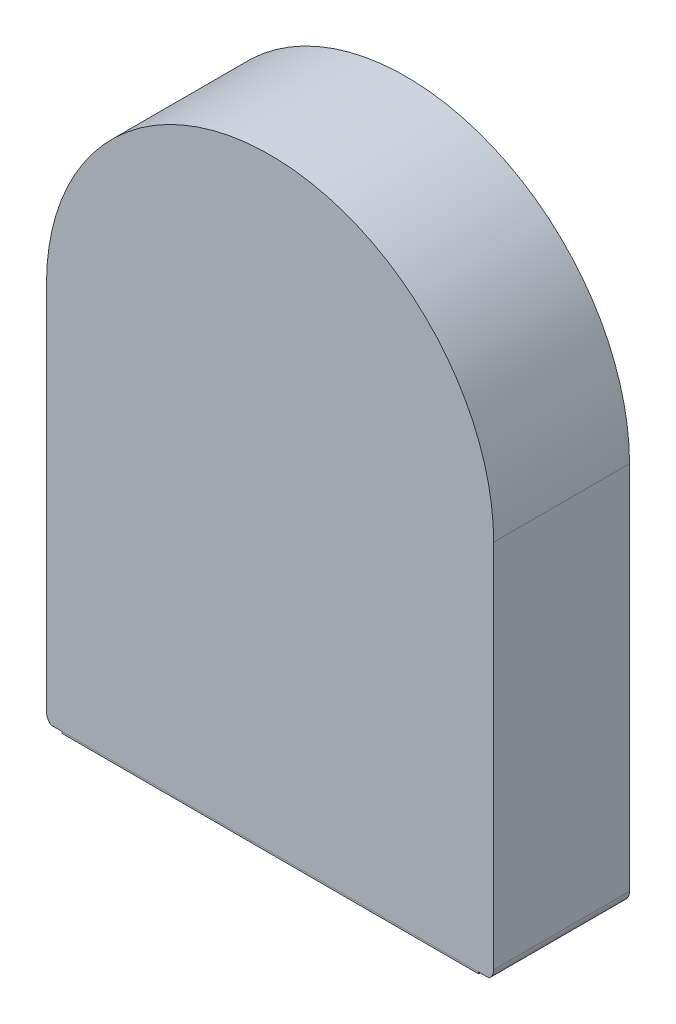
ISO-10303-21;
HEADER;
FILE_DESCRIPTION(('STEP AP214'),'2;1');
FILE_NAME('part.step','',(''),(''),'','','');
FILE_SCHEMA(('AUTOMOTIVE_DESIGN { 1 0 10303 214 1 1 1 1 }'));
ENDSEC;
DATA;
#1=APPLICATION_CONTEXT('core data for automotive mechanical design processes');
#2=APPLICATION_PROTOCOL_DEFINITION('international standard','automotive_design',2000,#1);
#3=PRODUCT_CONTEXT('',#1,'mechanical');
#4=PRODUCT('Part','Part','',(#3));
#5=PRODUCT_RELATED_PRODUCT_CATEGORY('part','',(#4));
#6=PRODUCT_DEFINITION_FORMATION('','',#4);
#7=PRODUCT_DEFINITION_CONTEXT('part definition',#1,'design');
#8=PRODUCT_DEFINITION('design','',#6,#7);
#9=PRODUCT_DEFINITION_SHAPE('','',#8);
#10=(LENGTH_UNIT() NAMED_UNIT(*) SI_UNIT(.MILLI.,.METRE.));
#11=(NAMED_UNIT(*) PLANE_ANGLE_UNIT() SI_UNIT($,.RADIAN.));
#12=(NAMED_UNIT(*) SI_UNIT($,.STERADIAN.) SOLID_ANGLE_UNIT());
#13=UNCERTAINTY_MEASURE_WITH_UNIT(LENGTH_MEASURE(1.E-05),#10,'distance_accuracy_value','');
#14=(GEOMETRIC_REPRESENTATION_CONTEXT(3) GLOBAL_UNCERTAINTY_ASSIGNED_CONTEXT((#13)) GLOBAL_UNIT_ASSIGNED_CONTEXT((#10,
#11,#12)) REPRESENTATION_CONTEXT('',''));
#15=CARTESIAN_POINT('',(0.,0.,0.));
#16=DIRECTION('',(0.,0.,1.));
#17=DIRECTION('',(1.,0.,0.));
#18=AXIS2_PLACEMENT_3D('',#15,#16,#17);
#19=CARTESIAN_POINT('',(8.8,-15.4,5.65));
#20=DIRECTION('',(0.,0.,-1.));
#21=DIRECTION('',(-1.,0.,0.));
#22=AXIS2_PLACEMENT_3D('',#19,#20,#21);
#23=CYLINDRICAL_SURFACE('',#22,0.5);
#24=CARTESIAN_POINT('',(8.8,-15.4,6.03039935251033));
#25=DIRECTION('',(0.,0.713250449154018,-0.700909264300018));
#26=DIRECTION('',(0.,0.700909264300018,0.713250449154018));
#27=AXIS2_PLACEMENT_3D('',#24,#25,#26);
#28=ELLIPSE('',#27,0.713359097199747,0.5);
#29=CARTESIAN_POINT('',(9.10934525688194,-15.79281740293,5.63066545920087));
#30=VERTEX_POINT('',#29);
#31=CARTESIAN_POINT('',(8.8,-15.9,5.52159565602451));
#32=VERTEX_POINT('',#31);
#33=EDGE_CURVE('E56',#30,#32,#28,.T.);
#34=ORIENTED_EDGE('',*,*,#33,.T.);
#35=DIRECTION('',(0.,0.,-1.));
#36=VECTOR('',#35,1.);
#37=CARTESIAN_POINT('',(8.8,-15.9,5.65));
#38=LINE('',#37,#36);
#39=CARTESIAN_POINT('',(8.8,-15.9,0.));
#40=VERTEX_POINT('',#39);
#41=EDGE_CURVE('E258',#40,#32,#38,.F.);
#42=ORIENTED_EDGE('',*,*,#41,.F.);
#43=CARTESIAN_POINT('',(8.8,-15.4,0.));
#44=DIRECTION('',(0.,0.,1.));
#45=DIRECTION('',(1.,0.,0.));
#46=AXIS2_PLACEMENT_3D('',#43,#44,#45);
#47=CIRCLE('',#46,0.5);
#48=CARTESIAN_POINT('',(9.3,-15.4,0.));
#49=VERTEX_POINT('',#48);
#50=EDGE_CURVE('E262',#49,#40,#47,.F.);
#51=ORIENTED_EDGE('',*,*,#50,.F.);
#52=DIRECTION('',(0.,0.,-1.));
#53=VECTOR('',#52,1.);
#54=CARTESIAN_POINT('',(9.3,-15.4,5.65));
#55=LINE('',#54,#53);
#56=CARTESIAN_POINT('',(9.3,-15.4,5.65));
#57=VERTEX_POINT('',#56);
#58=EDGE_CURVE('E266',#57,#49,#55,.T.);
#59=ORIENTED_EDGE('',*,*,#58,.F.);
#60=CARTESIAN_POINT('',(8.8,-15.4,5.65));
#61=DIRECTION('',(0.,0.,1.));
#62=DIRECTION('',(1.,0.,0.));
#63=AXIS2_PLACEMENT_3D('',#60,#61,#62);
#64=CIRCLE('',#63,0.5);
#65=CARTESIAN_POINT('',(9.10934525688194,-15.79281740293,5.65));
#66=VERTEX_POINT('',#65);
#67=EDGE_CURVE('E253',#66,#57,#64,.T.);
#68=ORIENTED_EDGE('',*,*,#67,.F.);
#69=DIRECTION('',(0.,0.,-1.));
#70=VECTOR('',#69,1.);
#71=CARTESIAN_POINT('',(9.10934525730095,-15.7928174026,5.65));
#72=LINE('',#71,#70);
#73=EDGE_CURVE('E49',#30,#66,#72,.F.);
#74=ORIENTED_EDGE('',*,*,#73,.F.);
#75=EDGE_LOOP('',(#34,#42,#51,#59,#68,#74));
#76=FACE_BOUND('',#75,.T.);
#77=ADVANCED_FACE('F39',(#76),#23,.T.);
#78=CARTESIAN_POINT('',(-8.8,-15.4,5.65));
#79=DIRECTION('',(0.,0.,-1.));
#80=DIRECTION('',(-1.,0.,0.));
#81=AXIS2_PLACEMENT_3D('',#78,#79,#80);
#82=CYLINDRICAL_SURFACE('',#81,0.5);
#83=CARTESIAN_POINT('',(-8.8,-15.4,5.65));
#84=DIRECTION('',(0.,0.,1.));
#85=DIRECTION('',(1.,0.,0.));
#86=AXIS2_PLACEMENT_3D('',#83,#84,#85);
#87=CIRCLE('',#86,0.5);
#88=CARTESIAN_POINT('',(-9.3,-15.4,5.65));
#89=VERTEX_POINT('',#88);
#90=CARTESIAN_POINT('',(-9.10934525730095,-15.7928174026,5.65));
#91=VERTEX_POINT('',#90);
#92=EDGE_CURVE('E255',#89,#91,#87,.T.);
#93=ORIENTED_EDGE('',*,*,#92,.F.);
#94=DIRECTION('',(0.,0.,-1.));
#95=VECTOR('',#94,1.);
#96=CARTESIAN_POINT('',(-9.3,-15.4,5.65));
#97=LINE('',#96,#95);
#98=CARTESIAN_POINT('',(-9.3,-15.4,0.));
#99=VERTEX_POINT('',#98);
#100=EDGE_CURVE('E251',#99,#89,#97,.F.);
#101=ORIENTED_EDGE('',*,*,#100,.F.);
#102=CARTESIAN_POINT('',(-8.8,-15.4,0.));
#103=DIRECTION('',(0.,0.,1.));
#104=DIRECTION('',(1.,0.,0.));
#105=AXIS2_PLACEMENT_3D('',#102,#103,#104);
#106=CIRCLE('',#105,0.5);
#107=CARTESIAN_POINT('',(-8.8,-15.9,0.));
#108=VERTEX_POINT('',#107);
#109=EDGE_CURVE('E264',#108,#99,#106,.F.);
#110=ORIENTED_EDGE('',*,*,#109,.F.);
#111=DIRECTION('',(0.,0.,-1.));
#112=VECTOR('',#111,1.);
#113=CARTESIAN_POINT('',(-8.8,-15.9,5.65));
#114=LINE('',#113,#112);
#115=CARTESIAN_POINT('',(-8.8,-15.9,5.52159565602451));
#116=VERTEX_POINT('',#115);
#117=EDGE_CURVE('E260',#116,#108,#114,.T.);
#118=ORIENTED_EDGE('',*,*,#117,.F.);
#119=CARTESIAN_POINT('',(-8.8,-15.4,6.03039935251033));
#120=DIRECTION('',(0.,0.713250449154018,-0.700909264300018));
#121=DIRECTION('',(0.,0.700909264300018,0.713250449154018));
#122=AXIS2_PLACEMENT_3D('',#119,#120,#121);
#123=ELLIPSE('',#122,0.713359097199747,0.5);
#124=CARTESIAN_POINT('',(-9.10934525730095,-15.7928174026,5.63066545953665));
#125=VERTEX_POINT('',#124);
#126=EDGE_CURVE('E146',#116,#125,#123,.T.);
#127=ORIENTED_EDGE('',*,*,#126,.T.);
#128=DIRECTION('',(0.,0.,1.));
#129=VECTOR('',#128,1.);
#130=CARTESIAN_POINT('',(-9.10934525730095,-15.7928174026,5.63066545953665));
#131=LINE('',#130,#129);
#132=EDGE_CURVE('E196',#125,#91,#131,.T.);
#133=ORIENTED_EDGE('',*,*,#132,.T.);
#134=EDGE_LOOP('',(#93,#101,#110,#118,#127,#133));
#135=FACE_BOUND('',#134,.T.);
#136=ADVANCED_FACE('F41',(#135),#82,.T.);
#137=CARTESIAN_POINT('',(0.,0.,5.65));
#138=DIRECTION('',(0.,0.,-1.));
#139=DIRECTION('',(-1.,0.,0.));
#140=AXIS2_PLACEMENT_3D('',#137,#138,#139);
#141=CYLINDRICAL_SURFACE('',#140,9.3);
#142=CARTESIAN_POINT('',(0.,0.,0.));
#143=DIRECTION('',(0.,0.,1.));
#144=DIRECTION('',(1.,0.,0.));
#145=AXIS2_PLACEMENT_3D('',#142,#143,#144);
#146=CIRCLE('',#145,9.3);
#147=CARTESIAN_POINT('',(9.3,0.,0.));
#148=VERTEX_POINT('',#147);
#149=CARTESIAN_POINT('',(-9.3,0.,0.));
#150=VERTEX_POINT('',#149);
#151=EDGE_CURVE('E201',#148,#150,#146,.T.);
#152=ORIENTED_EDGE('',*,*,#151,.T.);
#153=DIRECTION('',(0.,0.,-1.));
#154=VECTOR('',#153,1.);
#155=CARTESIAN_POINT('',(-9.3,0.,5.65));
#156=LINE('',#155,#154);
#157=CARTESIAN_POINT('',(-9.3,0.,5.65));
#158=VERTEX_POINT('',#157);
#159=EDGE_CURVE('E268',#158,#150,#156,.T.);
#160=ORIENTED_EDGE('',*,*,#159,.F.);
#161=CARTESIAN_POINT('',(0.,0.,5.65));
#162=DIRECTION('',(0.,0.,1.));
#163=DIRECTION('',(1.,0.,0.));
#164=AXIS2_PLACEMENT_3D('',#161,#162,#163);
#165=CIRCLE('',#164,9.3);
#166=CARTESIAN_POINT('',(9.3,0.,5.65));
#167=VERTEX_POINT('',#166);
#168=EDGE_CURVE('E245',#167,#158,#165,.T.);
#169=ORIENTED_EDGE('',*,*,#168,.F.);
#170=DIRECTION('',(0.,0.,-1.));
#171=VECTOR('',#170,1.);
#172=CARTESIAN_POINT('',(9.3,0.,5.65));
#173=LINE('',#172,#171);
#174=EDGE_CURVE('E270',#167,#148,#173,.T.);
#175=ORIENTED_EDGE('',*,*,#174,.T.);
#176=EDGE_LOOP('',(#152,#160,#169,#175));
#177=FACE_BOUND('',#176,.T.);
#178=ADVANCED_FACE('F358',(#177),#141,.T.);
#179=CARTESIAN_POINT('',(-9.3,0.,5.65));
#180=DIRECTION('',(1.,0.,0.));
#181=DIRECTION('',(0.,1.,0.));
#182=AXIS2_PLACEMENT_3D('',#179,#180,#181);
#183=PLANE('',#182);
#184=ORIENTED_EDGE('',*,*,#159,.T.);
#185=DIRECTION('',(0.,-1.,0.));
#186=VECTOR('',#185,1.);
#187=CARTESIAN_POINT('',(-9.3,0.,0.));
#188=LINE('',#187,#186);
#189=EDGE_CURVE('E278',#150,#99,#188,.T.);
#190=ORIENTED_EDGE('',*,*,#189,.T.);
#191=ORIENTED_EDGE('',*,*,#100,.T.);
#192=DIRECTION('',(0.,-1.,0.));
#193=VECTOR('',#192,1.);
#194=CARTESIAN_POINT('',(-9.3,0.,5.65));
#195=LINE('',#194,#193);
#196=EDGE_CURVE('E242',#158,#89,#195,.T.);
#197=ORIENTED_EDGE('',*,*,#196,.F.);
#198=EDGE_LOOP('',(#184,#190,#191,#197));
#199=FACE_BOUND('',#198,.T.);
#200=ADVANCED_FACE('F359',(#199),#183,.F.);
#201=CARTESIAN_POINT('',(-9.3,-15.9,5.65));
#202=DIRECTION('',(0.,1.,0.));
#203=DIRECTION('',(0.,0.,1.));
#204=AXIS2_PLACEMENT_3D('',#201,#202,#203);
#205=PLANE('',#204);
#206=ORIENTED_EDGE('',*,*,#41,.T.);
#207=DIRECTION('',(-1.,0.,0.));
#208=VECTOR('',#207,1.);
#209=CARTESIAN_POINT('',(0.,-15.9,5.52159565602451));
#210=LINE('',#209,#208);
#211=EDGE_CURVE('E338',#32,#116,#210,.T.);
#212=ORIENTED_EDGE('',*,*,#211,.T.);
#213=ORIENTED_EDGE('',*,*,#117,.T.);
#214=DIRECTION('',(1.,0.,0.));
#215=VECTOR('',#214,1.);
#216=CARTESIAN_POINT('',(-9.3,-15.9,0.));
#217=LINE('',#216,#215);
#218=EDGE_CURVE('E275',#108,#40,#217,.T.);
#219=ORIENTED_EDGE('',*,*,#218,.T.);
#220=EDGE_LOOP('',(#206,#212,#213,#219));
#221=FACE_BOUND('',#220,.T.);
#222=ADVANCED_FACE('F344',(#221),#205,.F.);
#223=CARTESIAN_POINT('',(9.3,0.,5.65));
#224=DIRECTION('',(-1.,0.,0.));
#225=DIRECTION('',(0.,-1.,0.));
#226=AXIS2_PLACEMENT_3D('',#223,#224,#225);
#227=PLANE('',#226);
#228=ORIENTED_EDGE('',*,*,#58,.T.);
#229=DIRECTION('',(0.,1.,0.));
#230=VECTOR('',#229,1.);
#231=CARTESIAN_POINT('',(9.3,0.,0.));
#232=LINE('',#231,#230);
#233=EDGE_CURVE('E248',#49,#148,#232,.T.);
#234=ORIENTED_EDGE('',*,*,#233,.T.);
#235=ORIENTED_EDGE('',*,*,#174,.F.);
#236=DIRECTION('',(0.,1.,0.));
#237=VECTOR('',#236,1.);
#238=CARTESIAN_POINT('',(9.3,0.,5.65));
#239=LINE('',#238,#237);
#240=EDGE_CURVE('E272',#57,#167,#239,.T.);
#241=ORIENTED_EDGE('',*,*,#240,.F.);
#242=EDGE_LOOP('',(#228,#234,#235,#241));
#243=FACE_BOUND('',#242,.T.);
#244=ADVANCED_FACE('F355',(#243),#227,.F.);
#245=CARTESIAN_POINT('',(0.,0.,5.65));
#246=DIRECTION('',(0.,0.,1.));
#247=DIRECTION('',(1.,0.,0.));
#248=AXIS2_PLACEMENT_3D('',#245,#246,#247);
#249=PLANE('',#248);
#250=DIRECTION('',(1.,0.,0.));
#251=VECTOR('',#250,1.);
#252=CARTESIAN_POINT('',(-5.00000000075,-15.7926514013,5.64999710245));
#253=LINE('',#252,#251);
#254=CARTESIAN_POINT('',(-6.97971042440521,-15.7927344019421,5.64999855122482));
#255=VERTEX_POINT('',#254);
#256=CARTESIAN_POINT('',(2.97381740255382,-15.7926513759911,5.64999855122139));
#257=VERTEX_POINT('',#256);
#258=EDGE_CURVE('E177',#255,#257,#253,.T.);
#259=ORIENTED_EDGE('',*,*,#258,.T.);
#260=DIRECTION('',(0.999999999999744,1.24820653344968E-08,7.15097058320817E-07));
#261=VECTOR('',#260,1.);
#262=CARTESIAN_POINT('',(4.99999999925,-15.792651376,5.64999855136));
#263=LINE('',#262,#261);
#264=CARTESIAN_POINT('',(6.97971041935568,-15.7927343769389,5.64999998352249));
#265=VERTEX_POINT('',#264);
#266=EDGE_CURVE('E180',#257,#265,#263,.T.);
#267=ORIENTED_EDGE('',*,*,#266,.T.);
#268=DIRECTION('',(-1.,0.,0.));
#269=VECTOR('',#268,1.);
#270=CARTESIAN_POINT('',(0.,-15.7928174026,5.65));
#271=LINE('',#270,#269);
#272=EDGE_CURVE('E199',#66,#265,#271,.T.);
#273=ORIENTED_EDGE('',*,*,#272,.F.);
#274=ORIENTED_EDGE('',*,*,#67,.T.);
#275=ORIENTED_EDGE('',*,*,#240,.T.);
#276=ORIENTED_EDGE('',*,*,#168,.T.);
#277=ORIENTED_EDGE('',*,*,#196,.T.);
#278=ORIENTED_EDGE('',*,*,#92,.T.);
#279=DIRECTION('',(-1.,0.,0.));
#280=VECTOR('',#279,1.);
#281=CARTESIAN_POINT('',(0.,-15.7928174026,5.65));
#282=LINE('',#281,#280);
#283=EDGE_CURVE('E11',#255,#91,#282,.T.);
#284=ORIENTED_EDGE('',*,*,#283,.F.);
#285=EDGE_LOOP('',(#259,#267,#273,#274,#275,#276,#277,#278,#284));
#286=FACE_BOUND('',#285,.T.);
#287=ADVANCED_FACE('F288',(#286),#249,.T.);
#288=CARTESIAN_POINT('',(0.,0.,0.));
#289=DIRECTION('',(0.,0.,1.));
#290=DIRECTION('',(1.,0.,0.));
#291=AXIS2_PLACEMENT_3D('',#288,#289,#290);
#292=PLANE('',#291);
#293=ORIENTED_EDGE('',*,*,#233,.F.);
#294=ORIENTED_EDGE('',*,*,#50,.T.);
#295=ORIENTED_EDGE('',*,*,#218,.F.);
#296=ORIENTED_EDGE('',*,*,#109,.T.);
#297=ORIENTED_EDGE('',*,*,#189,.F.);
#298=ORIENTED_EDGE('',*,*,#151,.F.);
#299=EDGE_LOOP('',(#293,#294,#295,#296,#297,#298));
#300=FACE_BOUND('',#299,.T.);
#301=ADVANCED_FACE('F221',(#300),#292,.F.);
#302=CARTESIAN_POINT('',(-10.,-15.7928174026,7.15));
#303=DIRECTION('',(0.,1.,0.));
#304=DIRECTION('',(0.,0.,1.));
#305=AXIS2_PLACEMENT_3D('',#302,#303,#304);
#306=PLANE('',#305);
#307=ORIENTED_EDGE('',*,*,#272,.T.);
#308=CARTESIAN_POINT('',(6.97975192830906,-15.7928174026,5.64048689252252));
#309=DIRECTION('',(-0.00436264473487639,0.0174522403538263,0.999838180225955));
#310=VECTOR('',#309,1.);
#311=LINE('',#308,#310);
#312=CARTESIAN_POINT('',(6.97975192830905,-15.7928174026,5.64048689252252));
#313=VERTEX_POINT('',#312);
#314=EDGE_CURVE('E188',#313,#265,#311,.T.);
#315=ORIENTED_EDGE('',*,*,#314,.F.);
#316=DIRECTION('',(1.,0.,0.));
#317=VECTOR('',#316,1.);
#318=CARTESIAN_POINT('',(-8.66700053469144,-15.7928174026,5.64048689252252));
#319=LINE('',#318,#317);
#320=CARTESIAN_POINT('',(8.66820089689577,-15.7928174026,5.64048689252252));
#321=VERTEX_POINT('',#320);
#322=EDGE_CURVE('E161',#313,#321,#319,.T.);
#323=ORIENTED_EDGE('',*,*,#322,.T.);
#324=DIRECTION('',(0.,0.,-1.));
#325=VECTOR('',#324,1.);
#326=CARTESIAN_POINT('',(8.66820089689577,-15.7928174026,0.999999999999998));
#327=LINE('',#326,#325);
#328=CARTESIAN_POINT('',(8.66821322781486,-15.7928174036935,5.63066545842397));
#329=VERTEX_POINT('',#328);
#330=EDGE_CURVE('E153',#321,#329,#327,.T.);
#331=ORIENTED_EDGE('',*,*,#330,.T.);
#332=DIRECTION('',(-1.,-1.73074002985439E-09,-1.7612138496918E-09));
#333=VECTOR('',#332,1.);
#334=CARTESIAN_POINT('',(-4.9999999983754,-15.7928174273496,5.6306654343513));
#335=LINE('',#334,#333);
#336=EDGE_CURVE('E137',#30,#329,#335,.T.);
#337=ORIENTED_EDGE('',*,*,#336,.F.);
#338=ORIENTED_EDGE('',*,*,#73,.T.);
#339=EDGE_LOOP('',(#307,#315,#323,#331,#337,#338));
#340=FACE_BOUND('',#339,.T.);
#341=ADVANCED_FACE('F158',(#340),#306,.F.);
#342=CARTESIAN_POINT('',(8.27396970801,-15.8738174032,0.999999999999998));
#343=DIRECTION('',(0.,-1.,0.));
#344=DIRECTION('',(0.,0.,-1.));
#345=AXIS2_PLACEMENT_3D('',#342,#343,#344);
#346=PLANE('',#345);
#347=DIRECTION('',(1.,0.,0.));
#348=VECTOR('',#347,1.);
#349=CARTESIAN_POINT('',(8.27396970801,-15.8738174032,5.54823926009538));
#350=LINE('',#349,#348);
#351=CARTESIAN_POINT('',(-8.66700053469144,-15.8738174032,5.54823926009538));
#352=VERTEX_POINT('',#351);
#353=CARTESIAN_POINT('',(8.66820089689577,-15.8738174032,5.54823926009538));
#354=VERTEX_POINT('',#353);
#355=EDGE_CURVE('E156',#352,#354,#350,.T.);
#356=ORIENTED_EDGE('',*,*,#355,.T.);
#357=DIRECTION('',(0.,0.,-1.));
#358=VECTOR('',#357,1.);
#359=CARTESIAN_POINT('',(8.66820089689577,-15.8738174032,0.999999999999998));
#360=LINE('',#359,#358);
#361=CARTESIAN_POINT('',(8.66820089689577,-15.8738174032,5.64048689252252));
#362=VERTEX_POINT('',#361);
#363=EDGE_CURVE('E154',#362,#354,#360,.T.);
#364=ORIENTED_EDGE('',*,*,#363,.F.);
#365=DIRECTION('',(1.,0.,0.));
#366=VECTOR('',#365,1.);
#367=CARTESIAN_POINT('',(-8.66700053469144,-15.8738174032,5.64048689252252));
#368=LINE('',#367,#366);
#369=CARTESIAN_POINT('',(-8.66700053469144,-15.8738174032,5.64048689252252));
#370=VERTEX_POINT('',#369);
#371=EDGE_CURVE('E163',#370,#362,#368,.T.);
#372=ORIENTED_EDGE('',*,*,#371,.F.);
#373=DIRECTION('',(0.,0.,1.));
#374=VECTOR('',#373,1.);
#375=CARTESIAN_POINT('',(-8.66700053469144,-15.8738174032,0.999999999999998));
#376=LINE('',#375,#374);
#377=EDGE_CURVE('E322',#352,#370,#376,.T.);
#378=ORIENTED_EDGE('',*,*,#377,.F.);
#379=EDGE_LOOP('',(#356,#364,#372,#378));
#380=FACE_BOUND('',#379,.T.);
#381=ADVANCED_FACE('F220',(#380),#346,.T.);
#382=ORIENTED_EDGE('',*,*,#283,.T.);
#383=ORIENTED_EDGE('',*,*,#132,.F.);
#384=DIRECTION('',(-1.,0.,0.));
#385=VECTOR('',#384,1.);
#386=CARTESIAN_POINT('',(-10.,-15.7928174026,5.63066545953665));
#387=LINE('',#386,#385);
#388=CARTESIAN_POINT('',(-8.66700053469144,-15.7928174026,5.63066545953665));
#389=VERTEX_POINT('',#388);
#390=EDGE_CURVE('E298',#389,#125,#387,.T.);
#391=ORIENTED_EDGE('',*,*,#390,.F.);
#392=DIRECTION('',(0.,0.,1.));
#393=VECTOR('',#392,1.);
#394=CARTESIAN_POINT('',(-8.66700053469144,-15.7928174026,0.999999999999998));
#395=LINE('',#394,#393);
#396=CARTESIAN_POINT('',(-8.66700053469144,-15.7928174026,5.64048689252252));
#397=VERTEX_POINT('',#396);
#398=EDGE_CURVE('E155',#389,#397,#395,.T.);
#399=ORIENTED_EDGE('',*,*,#398,.T.);
#400=CARTESIAN_POINT('',(-6.97975192710905,-15.7928174026,5.64048689252252));
#401=VERTEX_POINT('',#400);
#402=EDGE_CURVE('E164',#397,#401,#319,.T.);
#403=ORIENTED_EDGE('',*,*,#402,.T.);
#404=CARTESIAN_POINT('',(-6.97971043072667,-15.7926514012683,5.64999710244945));
#405=DIRECTION('',(-0.00436264475399805,-0.0174522403537114,-0.999838180225874));
#406=VECTOR('',#405,1.);
#407=LINE('',#404,#406);
#408=EDGE_CURVE('E204',#255,#401,#407,.T.);
#409=ORIENTED_EDGE('',*,*,#408,.F.);
#410=EDGE_LOOP('',(#382,#383,#391,#399,#403,#409));
#411=FACE_BOUND('',#410,.T.);
#412=ADVANCED_FACE('F222',(#411),#306,.F.);
#413=CARTESIAN_POINT('',(8.66820089689577,-33.8193830747908,0.999999999999998));
#414=DIRECTION('',(1.,0.,0.));
#415=DIRECTION('',(0.,0.,-1.));
#416=AXIS2_PLACEMENT_3D('',#413,#414,#415);
#417=PLANE('',#416);
#418=DIRECTION('',(0.,0.700909264300018,0.713250449154018));
#419=VECTOR('',#418,1.);
#420=CARTESIAN_POINT('',(8.66820089689578,-26.9637768566889,-5.73698546753076));
#421=LINE('',#420,#419);
#422=EDGE_CURVE('E141',#354,#329,#421,.T.);
#423=ORIENTED_EDGE('',*,*,#422,.T.);
#424=ORIENTED_EDGE('',*,*,#330,.F.);
#425=DIRECTION('',(0.,1.,0.));
#426=VECTOR('',#425,1.);
#427=CARTESIAN_POINT('',(8.66820089689577,-33.8193830747908,5.64048689252252));
#428=LINE('',#427,#426);
#429=EDGE_CURVE('E167',#362,#321,#428,.T.);
#430=ORIENTED_EDGE('',*,*,#429,.F.);
#431=ORIENTED_EDGE('',*,*,#363,.T.);
#432=EDGE_LOOP('',(#423,#424,#430,#431));
#433=FACE_BOUND('',#432,.T.);
#434=ADVANCED_FACE('F151',(#433),#417,.T.);
#435=CARTESIAN_POINT('',(-8.66700053469144,-33.8193830747908,0.999999999999998));
#436=DIRECTION('',(-1.,0.,0.));
#437=DIRECTION('',(0.,0.,1.));
#438=AXIS2_PLACEMENT_3D('',#435,#436,#437);
#439=PLANE('',#438);
#440=DIRECTION('',(0.,-0.700909264300018,-0.713250449154018));
#441=VECTOR('',#440,1.);
#442=CARTESIAN_POINT('',(-8.66700053469144,-26.9637768566889,-5.73698546753076));
#443=LINE('',#442,#441);
#444=EDGE_CURVE('E147',#389,#352,#443,.T.);
#445=ORIENTED_EDGE('',*,*,#444,.T.);
#446=ORIENTED_EDGE('',*,*,#377,.T.);
#447=DIRECTION('',(0.,1.,0.));
#448=VECTOR('',#447,1.);
#449=CARTESIAN_POINT('',(-8.66700053469144,-33.8193830747908,5.64048689252252));
#450=LINE('',#449,#448);
#451=EDGE_CURVE('E324',#370,#397,#450,.T.);
#452=ORIENTED_EDGE('',*,*,#451,.T.);
#453=ORIENTED_EDGE('',*,*,#398,.F.);
#454=EDGE_LOOP('',(#445,#446,#452,#453));
#455=FACE_BOUND('',#454,.T.);
#456=ADVANCED_FACE('F444',(#455),#439,.T.);
#457=CARTESIAN_POINT('',(9.3,-15.9,-0.500000000000002));
#458=DIRECTION('',(0.,-0.999847695156391,0.0174524064373068));
#459=DIRECTION('',(-1.,0.,0.));
#460=AXIS2_PLACEMENT_3D('',#457,#458,#459);
#461=PLANE('',#460);
#462=ORIENTED_EDGE('',*,*,#314,.T.);
#463=ORIENTED_EDGE('',*,*,#266,.F.);
#464=ORIENTED_EDGE('',*,*,#258,.F.);
#465=ORIENTED_EDGE('',*,*,#408,.T.);
#466=DIRECTION('',(-1.,0.,0.));
#467=VECTOR('',#466,1.);
#468=CARTESIAN_POINT('',(9.3,-15.7928174026,5.64048689252304));
#469=LINE('',#468,#467);
#470=EDGE_CURVE('E181',#313,#401,#469,.T.);
#471=ORIENTED_EDGE('',*,*,#470,.F.);
#472=EDGE_LOOP('',(#462,#463,#464,#465,#471));
#473=FACE_BOUND('',#472,.T.);
#474=ADVANCED_FACE('F225',(#473),#461,.T.);
#475=CARTESIAN_POINT('',(-8.66700053469144,-33.8193830747908,5.64048689252252));
#476=DIRECTION('',(0.,0.,1.));
#477=DIRECTION('',(1.,0.,0.));
#478=AXIS2_PLACEMENT_3D('',#475,#476,#477);
#479=PLANE('',#478);
#480=ORIENTED_EDGE('',*,*,#451,.F.);
#481=ORIENTED_EDGE('',*,*,#371,.T.);
#482=ORIENTED_EDGE('',*,*,#429,.T.);
#483=ORIENTED_EDGE('',*,*,#322,.F.);
#484=ORIENTED_EDGE('',*,*,#470,.T.);
#485=ORIENTED_EDGE('',*,*,#402,.F.);
#486=EDGE_LOOP('',(#480,#481,#482,#483,#484,#485));
#487=FACE_BOUND('',#486,.T.);
#488=ADVANCED_FACE('F223',(#487),#479,.T.);
#489=CARTESIAN_POINT('',(-5.,-15.3316709855,6.09993146282));
#490=DIRECTION('',(0.,0.713250449154018,-0.700909264300018));
#491=DIRECTION('',(-1.,0.,0.));
#492=AXIS2_PLACEMENT_3D('',#489,#490,#491);
#493=PLANE('',#492);
#494=ORIENTED_EDGE('',*,*,#336,.T.);
#495=ORIENTED_EDGE('',*,*,#422,.F.);
#496=ORIENTED_EDGE('',*,*,#355,.F.);
#497=ORIENTED_EDGE('',*,*,#444,.F.);
#498=ORIENTED_EDGE('',*,*,#390,.T.);
#499=ORIENTED_EDGE('',*,*,#126,.F.);
#500=ORIENTED_EDGE('',*,*,#211,.F.);
#501=ORIENTED_EDGE('',*,*,#33,.F.);
#502=EDGE_LOOP('',(#494,#495,#496,#497,#498,#499,#500,#501));
#503=FACE_BOUND('',#502,.T.);
#504=ADVANCED_FACE('F139',(#503),#493,.F.);
#505=CLOSED_SHELL('',(#77,#136,#178,#200,#222,#244,#287,#301,#341,#381,#412,#434,#456,#474,#488,#504));
#506=MANIFOLD_SOLID_BREP('B2',#505);
#507=ADVANCED_BREP_SHAPE_REPRESENTATION('',(#18,#506),#14);
#508=SHAPE_DEFINITION_REPRESENTATION(#9,#507);
ENDSEC;
END-ISO-10303-21;
